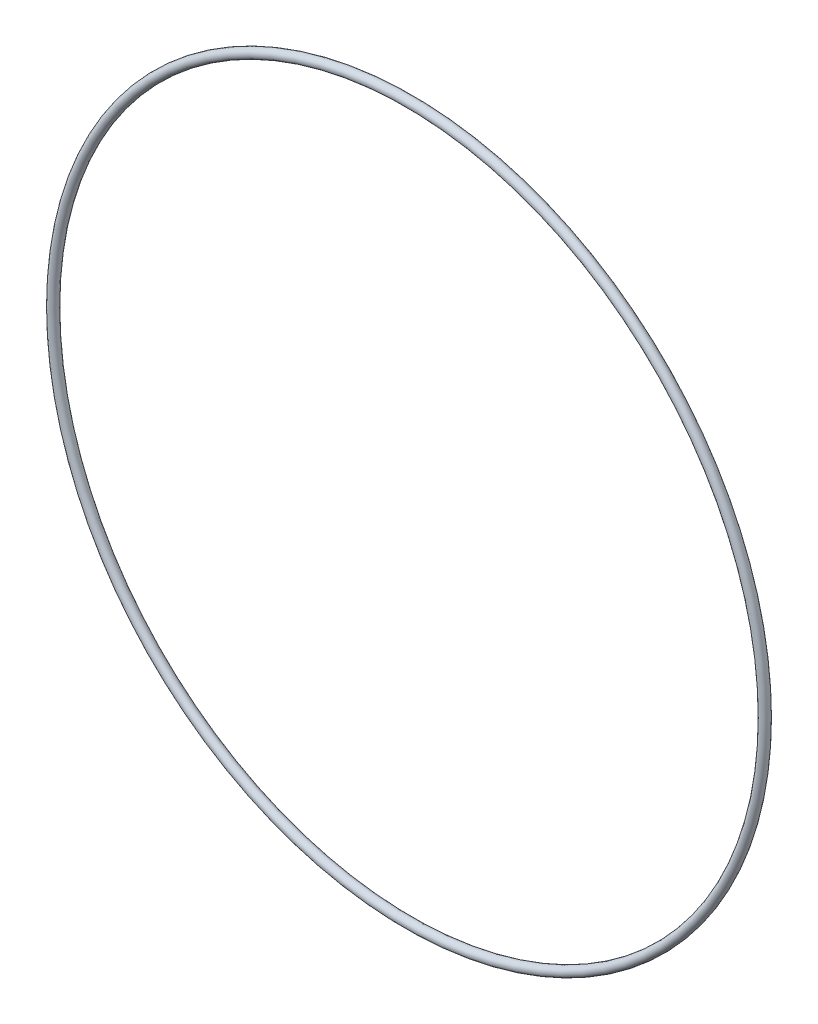
ISO-10303-21;
HEADER;
FILE_DESCRIPTION(('STEP AP214'),'2;1');
FILE_NAME('part.step','',(''),(''),'','','');
FILE_SCHEMA(('AUTOMOTIVE_DESIGN { 1 0 10303 214 1 1 1 1 }'));
ENDSEC;
DATA;
#1=APPLICATION_CONTEXT('core data for automotive mechanical design processes');
#2=APPLICATION_PROTOCOL_DEFINITION('international standard','automotive_design',2000,#1);
#3=PRODUCT_CONTEXT('',#1,'mechanical');
#4=PRODUCT('Part','Part','',(#3));
#5=PRODUCT_RELATED_PRODUCT_CATEGORY('part','',(#4));
#6=PRODUCT_DEFINITION_FORMATION('','',#4);
#7=PRODUCT_DEFINITION_CONTEXT('part definition',#1,'design');
#8=PRODUCT_DEFINITION('design','',#6,#7);
#9=PRODUCT_DEFINITION_SHAPE('','',#8);
#10=(LENGTH_UNIT() NAMED_UNIT(*) SI_UNIT(.MILLI.,.METRE.));
#11=(NAMED_UNIT(*) PLANE_ANGLE_UNIT() SI_UNIT($,.RADIAN.));
#12=(NAMED_UNIT(*) SI_UNIT($,.STERADIAN.) SOLID_ANGLE_UNIT());
#13=UNCERTAINTY_MEASURE_WITH_UNIT(LENGTH_MEASURE(1.E-05),#10,'distance_accuracy_value','');
#14=(GEOMETRIC_REPRESENTATION_CONTEXT(3) GLOBAL_UNCERTAINTY_ASSIGNED_CONTEXT((#13)) GLOBAL_UNIT_ASSIGNED_CONTEXT((#10,
#11,#12)) REPRESENTATION_CONTEXT('',''));
#15=CARTESIAN_POINT('',(0.,0.,0.));
#16=DIRECTION('',(0.,0.,1.));
#17=DIRECTION('',(1.,0.,0.));
#18=AXIS2_PLACEMENT_3D('',#15,#16,#17);
#19=CARTESIAN_POINT('',(0.,0.,0.));
#20=DIRECTION('',(0.,0.,1.));
#21=DIRECTION('',(1.,0.,0.));
#22=AXIS2_PLACEMENT_3D('',#19,#20,#21);
#23=TOROIDAL_SURFACE('',#22,67.4243,0.889000000000003);
#24=CARTESIAN_POINT('',(68.3133,0.,0.));
#25=VERTEX_POINT('',#24);
#26=VERTEX_LOOP('',#25);
#27=FACE_BOUND('',#26,.T.);
#28=ADVANCED_FACE('F30',(#27),#23,.T.);
#29=CLOSED_SHELL('',(#28));
#30=MANIFOLD_SOLID_BREP('B2',#29);
#31=ADVANCED_BREP_SHAPE_REPRESENTATION('',(#18,#30),#14);
#32=SHAPE_DEFINITION_REPRESENTATION(#9,#31);
ENDSEC;
END-ISO-10303-21;
